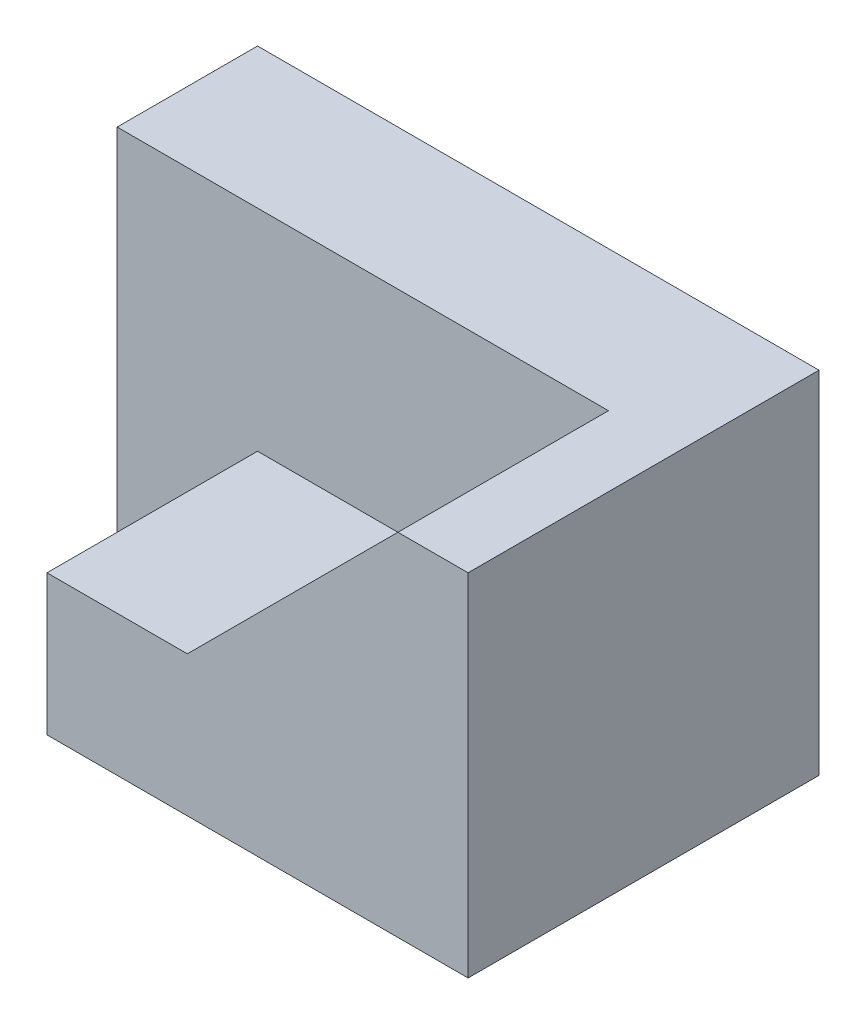
ISO-10303-21;
HEADER;
FILE_DESCRIPTION(('STEP AP214'),'2;1');
FILE_NAME('part.step','',(''),(''),'','','');
FILE_SCHEMA(('AUTOMOTIVE_DESIGN { 1 0 10303 214 1 1 1 1 }'));
ENDSEC;
DATA;
#1=APPLICATION_CONTEXT('core data for automotive mechanical design processes');
#2=APPLICATION_PROTOCOL_DEFINITION('international standard','automotive_design',2000,#1);
#3=PRODUCT_CONTEXT('',#1,'mechanical');
#4=PRODUCT('Part','Part','',(#3));
#5=PRODUCT_RELATED_PRODUCT_CATEGORY('part','',(#4));
#6=PRODUCT_DEFINITION_FORMATION('','',#4);
#7=PRODUCT_DEFINITION_CONTEXT('part definition',#1,'design');
#8=PRODUCT_DEFINITION('design','',#6,#7);
#9=PRODUCT_DEFINITION_SHAPE('','',#8);
#10=(LENGTH_UNIT() NAMED_UNIT(*) SI_UNIT(.MILLI.,.METRE.));
#11=(NAMED_UNIT(*) PLANE_ANGLE_UNIT() SI_UNIT($,.RADIAN.));
#12=(NAMED_UNIT(*) SI_UNIT($,.STERADIAN.) SOLID_ANGLE_UNIT());
#13=UNCERTAINTY_MEASURE_WITH_UNIT(LENGTH_MEASURE(1.E-05),#10,'distance_accuracy_value','');
#14=(GEOMETRIC_REPRESENTATION_CONTEXT(3) GLOBAL_UNCERTAINTY_ASSIGNED_CONTEXT((#13)) GLOBAL_UNIT_ASSIGNED_CONTEXT((#10,
#11,#12)) REPRESENTATION_CONTEXT('',''));
#15=CARTESIAN_POINT('',(0.,0.,0.));
#16=DIRECTION('',(0.,0.,1.));
#17=DIRECTION('',(1.,0.,0.));
#18=AXIS2_PLACEMENT_3D('',#15,#16,#17);
#19=CARTESIAN_POINT('',(0.,0.,50.));
#20=DIRECTION('',(1.,0.,0.));
#21=DIRECTION('',(0.,0.,-1.));
#22=AXIS2_PLACEMENT_3D('',#19,#20,#21);
#23=PLANE('',#22);
#24=DIRECTION('',(0.,0.,-1.));
#25=VECTOR('',#24,1.);
#26=CARTESIAN_POINT('',(0.,0.,50.));
#27=LINE('',#26,#25);
#28=CARTESIAN_POINT('',(0.,0.,20.));
#29=VERTEX_POINT('',#28);
#30=CARTESIAN_POINT('',(0.,0.,0.));
#31=VERTEX_POINT('',#30);
#32=EDGE_CURVE('E11',#29,#31,#27,.T.);
#33=ORIENTED_EDGE('',*,*,#32,.F.);
#34=DIRECTION('',(0.,-1.,0.));
#35=VECTOR('',#34,1.);
#36=CARTESIAN_POINT('',(0.,0.,20.));
#37=LINE('',#36,#35);
#38=CARTESIAN_POINT('',(0.,50.,20.));
#39=VERTEX_POINT('',#38);
#40=EDGE_CURVE('E82',#39,#29,#37,.T.);
#41=ORIENTED_EDGE('',*,*,#40,.F.);
#42=DIRECTION('',(0.,0.,-1.));
#43=VECTOR('',#42,1.);
#44=CARTESIAN_POINT('',(0.,50.,50.));
#45=LINE('',#44,#43);
#46=CARTESIAN_POINT('',(0.,50.,0.));
#47=VERTEX_POINT('',#46);
#48=EDGE_CURVE('E75',#39,#47,#45,.T.);
#49=ORIENTED_EDGE('',*,*,#48,.T.);
#50=DIRECTION('',(0.,-1.,0.));
#51=VECTOR('',#50,1.);
#52=CARTESIAN_POINT('',(0.,0.,0.));
#53=LINE('',#52,#51);
#54=EDGE_CURVE('E79',#47,#31,#53,.T.);
#55=ORIENTED_EDGE('',*,*,#54,.T.);
#56=EDGE_LOOP('',(#33,#41,#49,#55));
#57=FACE_BOUND('',#56,.T.);
#58=ADVANCED_FACE('F33',(#57),#23,.F.);
#59=CARTESIAN_POINT('',(0.,0.,50.));
#60=DIRECTION('',(0.,1.,0.));
#61=DIRECTION('',(0.,0.,1.));
#62=AXIS2_PLACEMENT_3D('',#59,#60,#61);
#63=PLANE('',#62);
#64=DIRECTION('',(1.,0.,0.));
#65=VECTOR('',#64,1.);
#66=CARTESIAN_POINT('',(0.,0.,50.));
#67=LINE('',#66,#65);
#68=CARTESIAN_POINT('',(20.,0.,50.));
#69=VERTEX_POINT('',#68);
#70=CARTESIAN_POINT('',(80.,0.,50.));
#71=VERTEX_POINT('',#70);
#72=EDGE_CURVE('E95',#69,#71,#67,.T.);
#73=ORIENTED_EDGE('',*,*,#72,.F.);
#74=DIRECTION('',(0.,0.,1.));
#75=VECTOR('',#74,1.);
#76=CARTESIAN_POINT('',(20.,0.,20.));
#77=LINE('',#76,#75);
#78=CARTESIAN_POINT('',(20.,0.,20.));
#79=VERTEX_POINT('',#78);
#80=EDGE_CURVE('E101',#79,#69,#77,.T.);
#81=ORIENTED_EDGE('',*,*,#80,.F.);
#82=DIRECTION('',(1.,0.,0.));
#83=VECTOR('',#82,1.);
#84=CARTESIAN_POINT('',(20.,0.,20.));
#85=LINE('',#84,#83);
#86=EDGE_CURVE('E122',#29,#79,#85,.T.);
#87=ORIENTED_EDGE('',*,*,#86,.F.);
#88=ORIENTED_EDGE('',*,*,#32,.T.);
#89=DIRECTION('',(1.,0.,0.));
#90=VECTOR('',#89,1.);
#91=CARTESIAN_POINT('',(0.,0.,0.));
#92=LINE('',#91,#90);
#93=CARTESIAN_POINT('',(80.,0.,0.));
#94=VERTEX_POINT('',#93);
#95=EDGE_CURVE('E100',#31,#94,#92,.T.);
#96=ORIENTED_EDGE('',*,*,#95,.T.);
#97=DIRECTION('',(0.,0.,-1.));
#98=VECTOR('',#97,1.);
#99=CARTESIAN_POINT('',(80.,0.,50.));
#100=LINE('',#99,#98);
#101=EDGE_CURVE('E40',#71,#94,#100,.T.);
#102=ORIENTED_EDGE('',*,*,#101,.F.);
#103=EDGE_LOOP('',(#73,#81,#87,#88,#96,#102));
#104=FACE_BOUND('',#103,.T.);
#105=ADVANCED_FACE('F116',(#104),#63,.F.);
#106=CARTESIAN_POINT('',(80.,0.,50.));
#107=DIRECTION('',(-1.,0.,0.));
#108=DIRECTION('',(0.,0.,1.));
#109=AXIS2_PLACEMENT_3D('',#106,#107,#108);
#110=PLANE('',#109);
#111=DIRECTION('',(0.,1.,0.));
#112=VECTOR('',#111,1.);
#113=CARTESIAN_POINT('',(80.,0.,0.));
#114=LINE('',#113,#112);
#115=CARTESIAN_POINT('',(80.,50.,0.));
#116=VERTEX_POINT('',#115);
#117=EDGE_CURVE('E96',#94,#116,#114,.T.);
#118=ORIENTED_EDGE('',*,*,#117,.T.);
#119=DIRECTION('',(0.,0.,-1.));
#120=VECTOR('',#119,1.);
#121=CARTESIAN_POINT('',(80.,50.,50.));
#122=LINE('',#121,#120);
#123=CARTESIAN_POINT('',(80.,50.,50.));
#124=VERTEX_POINT('',#123);
#125=EDGE_CURVE('E85',#124,#116,#122,.T.);
#126=ORIENTED_EDGE('',*,*,#125,.F.);
#127=DIRECTION('',(0.,1.,0.));
#128=VECTOR('',#127,1.);
#129=CARTESIAN_POINT('',(80.,0.,50.));
#130=LINE('',#129,#128);
#131=EDGE_CURVE('E56',#71,#124,#130,.T.);
#132=ORIENTED_EDGE('',*,*,#131,.F.);
#133=ORIENTED_EDGE('',*,*,#101,.T.);
#134=EDGE_LOOP('',(#118,#126,#132,#133));
#135=FACE_BOUND('',#134,.T.);
#136=ADVANCED_FACE('F113',(#135),#110,.F.);
#137=CARTESIAN_POINT('',(0.,50.,50.));
#138=DIRECTION('',(0.,-1.,0.));
#139=DIRECTION('',(0.,0.,-1.));
#140=AXIS2_PLACEMENT_3D('',#137,#138,#139);
#141=PLANE('',#140);
#142=DIRECTION('',(-1.,0.,0.));
#143=VECTOR('',#142,1.);
#144=CARTESIAN_POINT('',(0.,50.,20.));
#145=LINE('',#144,#143);
#146=CARTESIAN_POINT('',(70.,50.,20.));
#147=VERTEX_POINT('',#146);
#148=EDGE_CURVE('E158',#147,#39,#145,.T.);
#149=ORIENTED_EDGE('',*,*,#148,.F.);
#150=DIRECTION('',(0.,0.,1.));
#151=VECTOR('',#150,1.);
#152=CARTESIAN_POINT('',(70.,50.,20.));
#153=LINE('',#152,#151);
#154=CARTESIAN_POINT('',(70.,50.,50.));
#155=VERTEX_POINT('',#154);
#156=EDGE_CURVE('E104',#147,#155,#153,.T.);
#157=ORIENTED_EDGE('',*,*,#156,.T.);
#158=DIRECTION('',(-1.,0.,0.));
#159=VECTOR('',#158,1.);
#160=CARTESIAN_POINT('',(0.,50.,50.));
#161=LINE('',#160,#159);
#162=EDGE_CURVE('E86',#124,#155,#161,.T.);
#163=ORIENTED_EDGE('',*,*,#162,.F.);
#164=ORIENTED_EDGE('',*,*,#125,.T.);
#165=DIRECTION('',(-1.,0.,0.));
#166=VECTOR('',#165,1.);
#167=CARTESIAN_POINT('',(0.,50.,0.));
#168=LINE('',#167,#166);
#169=EDGE_CURVE('E90',#116,#47,#168,.T.);
#170=ORIENTED_EDGE('',*,*,#169,.T.);
#171=ORIENTED_EDGE('',*,*,#48,.F.);
#172=EDGE_LOOP('',(#149,#157,#163,#164,#170,#171));
#173=FACE_BOUND('',#172,.T.);
#174=ADVANCED_FACE('F91',(#173),#141,.F.);
#175=CARTESIAN_POINT('',(0.,0.,50.));
#176=DIRECTION('',(0.,0.,-1.));
#177=DIRECTION('',(-1.,0.,0.));
#178=AXIS2_PLACEMENT_3D('',#175,#176,#177);
#179=PLANE('',#178);
#180=DIRECTION('',(1.,0.,0.));
#181=VECTOR('',#180,1.);
#182=CARTESIAN_POINT('',(40.,20.,50.));
#183=LINE('',#182,#181);
#184=CARTESIAN_POINT('',(20.,20.,50.));
#185=VERTEX_POINT('',#184);
#186=CARTESIAN_POINT('',(40.,20.,50.));
#187=VERTEX_POINT('',#186);
#188=EDGE_CURVE('E167',#185,#187,#183,.T.);
#189=ORIENTED_EDGE('',*,*,#188,.F.);
#190=DIRECTION('',(0.,1.,0.));
#191=VECTOR('',#190,1.);
#192=CARTESIAN_POINT('',(20.,20.,50.));
#193=LINE('',#192,#191);
#194=EDGE_CURVE('E47',#69,#185,#193,.T.);
#195=ORIENTED_EDGE('',*,*,#194,.F.);
#196=ORIENTED_EDGE('',*,*,#72,.T.);
#197=ORIENTED_EDGE('',*,*,#131,.T.);
#198=ORIENTED_EDGE('',*,*,#162,.T.);
#199=DIRECTION('',(0.707106781186547,0.707106781186548,0.));
#200=VECTOR('',#199,1.);
#201=CARTESIAN_POINT('',(70.,50.,50.));
#202=LINE('',#201,#200);
#203=EDGE_CURVE('E153',#187,#155,#202,.T.);
#204=ORIENTED_EDGE('',*,*,#203,.F.);
#205=EDGE_LOOP('',(#189,#195,#196,#197,#198,#204));
#206=FACE_BOUND('',#205,.T.);
#207=ADVANCED_FACE('F175',(#206),#179,.F.);
#208=CARTESIAN_POINT('',(0.,0.,0.));
#209=DIRECTION('',(0.,0.,-1.));
#210=DIRECTION('',(-1.,0.,0.));
#211=AXIS2_PLACEMENT_3D('',#208,#209,#210);
#212=PLANE('',#211);
#213=ORIENTED_EDGE('',*,*,#54,.F.);
#214=ORIENTED_EDGE('',*,*,#169,.F.);
#215=ORIENTED_EDGE('',*,*,#117,.F.);
#216=ORIENTED_EDGE('',*,*,#95,.F.);
#217=EDGE_LOOP('',(#213,#214,#215,#216));
#218=FACE_BOUND('',#217,.T.);
#219=ADVANCED_FACE('F99',(#218),#212,.T.);
#220=CARTESIAN_POINT('',(20.,20.,20.));
#221=DIRECTION('',(1.,0.,0.));
#222=DIRECTION('',(0.,1.,0.));
#223=AXIS2_PLACEMENT_3D('',#220,#221,#222);
#224=PLANE('',#223);
#225=ORIENTED_EDGE('',*,*,#194,.T.);
#226=DIRECTION('',(0.,0.,1.));
#227=VECTOR('',#226,1.);
#228=CARTESIAN_POINT('',(20.,20.,20.));
#229=LINE('',#228,#227);
#230=CARTESIAN_POINT('',(20.,20.,20.));
#231=VERTEX_POINT('',#230);
#232=EDGE_CURVE('E140',#231,#185,#229,.T.);
#233=ORIENTED_EDGE('',*,*,#232,.F.);
#234=DIRECTION('',(0.,1.,0.));
#235=VECTOR('',#234,1.);
#236=CARTESIAN_POINT('',(20.,20.,20.));
#237=LINE('',#236,#235);
#238=EDGE_CURVE('E170',#79,#231,#237,.T.);
#239=ORIENTED_EDGE('',*,*,#238,.F.);
#240=ORIENTED_EDGE('',*,*,#80,.T.);
#241=EDGE_LOOP('',(#225,#233,#239,#240));
#242=FACE_BOUND('',#241,.T.);
#243=ADVANCED_FACE('F179',(#242),#224,.F.);
#244=CARTESIAN_POINT('',(70.,50.,20.));
#245=DIRECTION('',(0.707106781186548,-0.707106781186547,0.));
#246=DIRECTION('',(0.707106781186547,0.707106781186548,0.));
#247=AXIS2_PLACEMENT_3D('',#244,#245,#246);
#248=PLANE('',#247);
#249=ORIENTED_EDGE('',*,*,#203,.T.);
#250=ORIENTED_EDGE('',*,*,#156,.F.);
#251=DIRECTION('',(0.707106781186547,0.707106781186548,0.));
#252=VECTOR('',#251,1.);
#253=CARTESIAN_POINT('',(70.,50.,20.));
#254=LINE('',#253,#252);
#255=CARTESIAN_POINT('',(40.,20.,20.));
#256=VERTEX_POINT('',#255);
#257=EDGE_CURVE('E150',#256,#147,#254,.T.);
#258=ORIENTED_EDGE('',*,*,#257,.F.);
#259=DIRECTION('',(0.,0.,1.));
#260=VECTOR('',#259,1.);
#261=CARTESIAN_POINT('',(40.,20.,20.));
#262=LINE('',#261,#260);
#263=EDGE_CURVE('E154',#256,#187,#262,.T.);
#264=ORIENTED_EDGE('',*,*,#263,.T.);
#265=EDGE_LOOP('',(#249,#250,#258,#264));
#266=FACE_BOUND('',#265,.T.);
#267=ADVANCED_FACE('F149',(#266),#248,.F.);
#268=CARTESIAN_POINT('',(40.,20.,20.));
#269=DIRECTION('',(0.,-1.,0.));
#270=DIRECTION('',(1.,0.,0.));
#271=AXIS2_PLACEMENT_3D('',#268,#269,#270);
#272=PLANE('',#271);
#273=ORIENTED_EDGE('',*,*,#188,.T.);
#274=ORIENTED_EDGE('',*,*,#263,.F.);
#275=DIRECTION('',(1.,0.,0.));
#276=VECTOR('',#275,1.);
#277=CARTESIAN_POINT('',(40.,20.,20.));
#278=LINE('',#277,#276);
#279=EDGE_CURVE('E159',#231,#256,#278,.T.);
#280=ORIENTED_EDGE('',*,*,#279,.F.);
#281=ORIENTED_EDGE('',*,*,#232,.T.);
#282=EDGE_LOOP('',(#273,#274,#280,#281));
#283=FACE_BOUND('',#282,.T.);
#284=ADVANCED_FACE('F177',(#283),#272,.F.);
#285=CARTESIAN_POINT('',(0.,0.,20.));
#286=DIRECTION('',(0.,0.,-1.));
#287=DIRECTION('',(-1.,0.,0.));
#288=AXIS2_PLACEMENT_3D('',#285,#286,#287);
#289=PLANE('',#288);
#290=ORIENTED_EDGE('',*,*,#238,.T.);
#291=ORIENTED_EDGE('',*,*,#279,.T.);
#292=ORIENTED_EDGE('',*,*,#257,.T.);
#293=ORIENTED_EDGE('',*,*,#148,.T.);
#294=ORIENTED_EDGE('',*,*,#40,.T.);
#295=ORIENTED_EDGE('',*,*,#86,.T.);
#296=EDGE_LOOP('',(#290,#291,#292,#293,#294,#295));
#297=FACE_BOUND('',#296,.T.);
#298=ADVANCED_FACE('F157',(#297),#289,.F.);
#299=CLOSED_SHELL('',(#58,#105,#136,#174,#207,#219,#243,#267,#284,#298));
#300=MANIFOLD_SOLID_BREP('B2',#299);
#301=ADVANCED_BREP_SHAPE_REPRESENTATION('',(#18,#300),#14);
#302=SHAPE_DEFINITION_REPRESENTATION(#9,#301);
ENDSEC;
END-ISO-10303-21;
